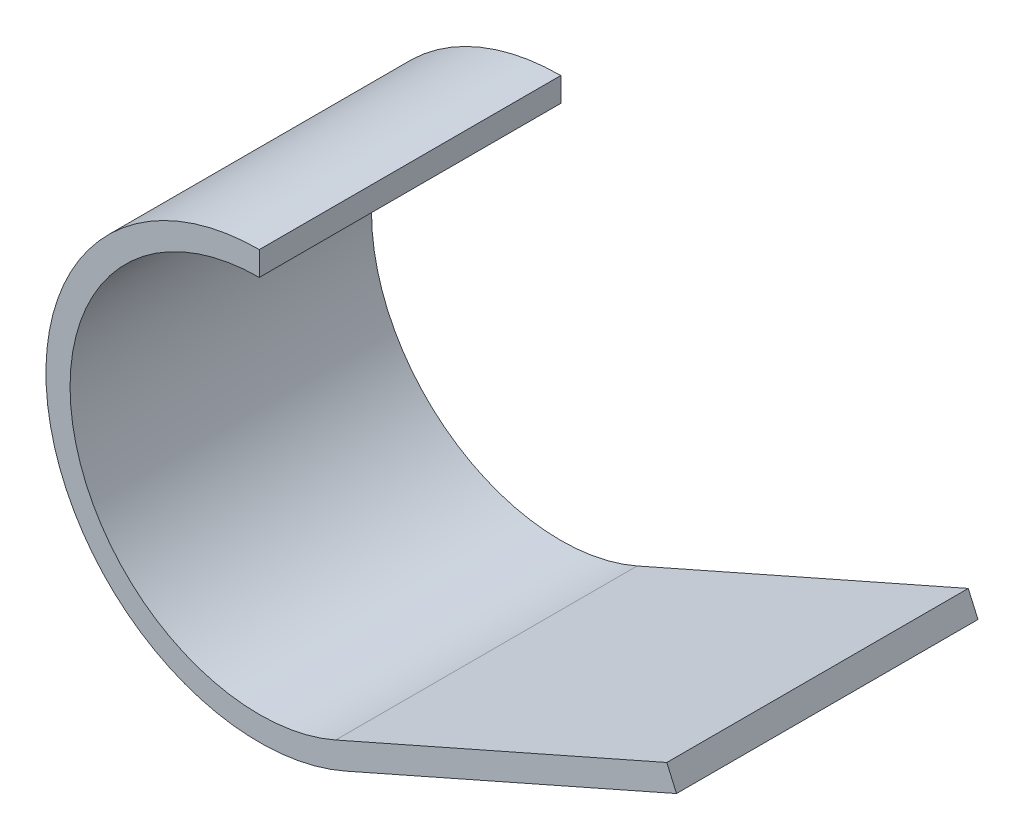
ISO-10303-21;
HEADER;
FILE_DESCRIPTION(('STEP AP214'),'2;1');
FILE_NAME('part.step','',(''),(''),'','','');
FILE_SCHEMA(('AUTOMOTIVE_DESIGN { 1 0 10303 214 1 1 1 1 }'));
ENDSEC;
DATA;
#1=APPLICATION_CONTEXT('core data for automotive mechanical design processes');
#2=APPLICATION_PROTOCOL_DEFINITION('international standard','automotive_design',2000,#1);
#3=PRODUCT_CONTEXT('',#1,'mechanical');
#4=PRODUCT('Part','Part','',(#3));
#5=PRODUCT_RELATED_PRODUCT_CATEGORY('part','',(#4));
#6=PRODUCT_DEFINITION_FORMATION('','',#4);
#7=PRODUCT_DEFINITION_CONTEXT('part definition',#1,'design');
#8=PRODUCT_DEFINITION('design','',#6,#7);
#9=PRODUCT_DEFINITION_SHAPE('','',#8);
#10=(LENGTH_UNIT() NAMED_UNIT(*) SI_UNIT(.MILLI.,.METRE.));
#11=(NAMED_UNIT(*) PLANE_ANGLE_UNIT() SI_UNIT($,.RADIAN.));
#12=(NAMED_UNIT(*) SI_UNIT($,.STERADIAN.) SOLID_ANGLE_UNIT());
#13=UNCERTAINTY_MEASURE_WITH_UNIT(LENGTH_MEASURE(1.E-05),#10,'distance_accuracy_value','');
#14=(GEOMETRIC_REPRESENTATION_CONTEXT(3) GLOBAL_UNCERTAINTY_ASSIGNED_CONTEXT((#13)) GLOBAL_UNIT_ASSIGNED_CONTEXT((#10,
#11,#12)) REPRESENTATION_CONTEXT('',''));
#15=CARTESIAN_POINT('',(0.,0.,0.));
#16=DIRECTION('',(0.,0.,1.));
#17=DIRECTION('',(1.,0.,0.));
#18=AXIS2_PLACEMENT_3D('',#15,#16,#17);
#19=CARTESIAN_POINT('',(25.5491782018338,-4.07503341783489,25.));
#20=DIRECTION('',(-0.403684262707082,0.914898363777441,0.));
#21=DIRECTION('',(-0.914898363777441,-0.403684262707082,0.));
#22=AXIS2_PLACEMENT_3D('',#19,#20,#21);
#23=PLANE('',#22);
#24=DIRECTION('',(0.914898363777441,0.403684262707082,0.));
#25=VECTOR('',#24,1.);
#26=CARTESIAN_POINT('',(25.5491782018338,-4.07503341783489,0.));
#27=LINE('',#26,#25);
#28=CARTESIAN_POINT('',(-1.90451938224641,-16.1885381595579,0.));
#29=VERTEX_POINT('',#28);
#30=CARTESIAN_POINT('',(25.5491782018338,-4.07503341783489,0.));
#31=VERTEX_POINT('',#30);
#32=EDGE_CURVE('E114',#29,#31,#27,.T.);
#33=ORIENTED_EDGE('',*,*,#32,.T.);
#34=DIRECTION('',(0.,0.,-1.));
#35=VECTOR('',#34,1.);
#36=CARTESIAN_POINT('',(25.5491782018338,-4.07503341783489,25.));
#37=LINE('',#36,#35);
#38=CARTESIAN_POINT('',(25.5491782018338,-4.07503341783489,25.));
#39=VERTEX_POINT('',#38);
#40=EDGE_CURVE('E11',#39,#31,#37,.T.);
#41=ORIENTED_EDGE('',*,*,#40,.F.);
#42=DIRECTION('',(0.914898363777441,0.403684262707082,0.));
#43=VECTOR('',#42,1.);
#44=CARTESIAN_POINT('',(25.5491782018338,-4.07503341783489,25.));
#45=LINE('',#44,#43);
#46=CARTESIAN_POINT('',(-1.90451938224641,-16.1885381595579,25.));
#47=VERTEX_POINT('',#46);
#48=EDGE_CURVE('E79',#47,#39,#45,.T.);
#49=ORIENTED_EDGE('',*,*,#48,.F.);
#50=DIRECTION('',(0.,0.,-1.));
#51=VECTOR('',#50,1.);
#52=CARTESIAN_POINT('',(-1.90451938224641,-16.1885381595579,25.));
#53=LINE('',#52,#51);
#54=EDGE_CURVE('E110',#47,#29,#53,.T.);
#55=ORIENTED_EDGE('',*,*,#54,.T.);
#56=EDGE_LOOP('',(#33,#41,#49,#55));
#57=FACE_BOUND('',#56,.T.);
#58=ADVANCED_FACE('F33',(#57),#23,.F.);
#59=CARTESIAN_POINT('',(24.7418096764197,-2.24523669028001,25.));
#60=DIRECTION('',(0.914898363777442,0.403684262707082,0.));
#61=DIRECTION('',(-0.403684262707082,0.914898363777442,0.));
#62=AXIS2_PLACEMENT_3D('',#59,#60,#61);
#63=PLANE('',#62);
#64=DIRECTION('',(0.403684262707082,-0.914898363777442,0.));
#65=VECTOR('',#64,1.);
#66=CARTESIAN_POINT('',(24.7418096764197,-2.24523669028001,0.));
#67=LINE('',#66,#65);
#68=CARTESIAN_POINT('',(24.7418096764197,-2.24523669028001,0.));
#69=VERTEX_POINT('',#68);
#70=EDGE_CURVE('E117',#69,#31,#67,.T.);
#71=ORIENTED_EDGE('',*,*,#70,.F.);
#72=DIRECTION('',(0.,0.,-1.));
#73=VECTOR('',#72,1.);
#74=CARTESIAN_POINT('',(24.7418096764197,-2.24523669028001,25.));
#75=LINE('',#74,#73);
#76=CARTESIAN_POINT('',(24.7418096764197,-2.24523669028001,25.));
#77=VERTEX_POINT('',#76);
#78=EDGE_CURVE('E41',#77,#69,#75,.T.);
#79=ORIENTED_EDGE('',*,*,#78,.F.);
#80=DIRECTION('',(0.403684262707082,-0.914898363777442,0.));
#81=VECTOR('',#80,1.);
#82=CARTESIAN_POINT('',(24.7418096764197,-2.24523669028001,25.));
#83=LINE('',#82,#81);
#84=EDGE_CURVE('E203',#77,#39,#83,.T.);
#85=ORIENTED_EDGE('',*,*,#84,.T.);
#86=ORIENTED_EDGE('',*,*,#40,.T.);
#87=EDGE_LOOP('',(#71,#79,#85,#86));
#88=FACE_BOUND('',#87,.T.);
#89=ADVANCED_FACE('F135',(#88),#63,.T.);
#90=CARTESIAN_POINT('',(24.7418096764197,-2.24523669028001,25.));
#91=DIRECTION('',(-0.403684262707082,0.914898363777441,0.));
#92=DIRECTION('',(-0.914898363777441,-0.403684262707082,0.));
#93=AXIS2_PLACEMENT_3D('',#90,#91,#92);
#94=PLANE('',#93);
#95=DIRECTION('',(0.914898363777441,0.403684262707082,0.));
#96=VECTOR('',#95,1.);
#97=CARTESIAN_POINT('',(24.7418096764197,-2.24523669028001,0.));
#98=LINE('',#97,#96);
#99=CARTESIAN_POINT('',(-2.71188790766057,-14.358741432003,0.));
#100=VERTEX_POINT('',#99);
#101=EDGE_CURVE('E120',#100,#69,#98,.T.);
#102=ORIENTED_EDGE('',*,*,#101,.F.);
#103=DIRECTION('',(0.,0.,-1.));
#104=VECTOR('',#103,1.);
#105=CARTESIAN_POINT('',(-2.71188790766057,-14.358741432003,25.));
#106=LINE('',#105,#104);
#107=CARTESIAN_POINT('',(-2.71188790766057,-14.358741432003,25.));
#108=VERTEX_POINT('',#107);
#109=EDGE_CURVE('E100',#108,#100,#106,.T.);
#110=ORIENTED_EDGE('',*,*,#109,.F.);
#111=DIRECTION('',(0.914898363777441,0.403684262707082,0.));
#112=VECTOR('',#111,1.);
#113=CARTESIAN_POINT('',(24.7418096764197,-2.24523669028001,25.));
#114=LINE('',#113,#112);
#115=EDGE_CURVE('E106',#108,#77,#114,.T.);
#116=ORIENTED_EDGE('',*,*,#115,.T.);
#117=ORIENTED_EDGE('',*,*,#78,.T.);
#118=EDGE_LOOP('',(#102,#110,#116,#117));
#119=FACE_BOUND('',#118,.T.);
#120=ADVANCED_FACE('F132',(#119),#94,.T.);
#121=CARTESIAN_POINT('',(-9.04745279428637,0.,25.));
#122=DIRECTION('',(0.,0.,-1.));
#123=DIRECTION('',(-1.,0.,0.));
#124=AXIS2_PLACEMENT_3D('',#121,#122,#123);
#125=CYLINDRICAL_SURFACE('',#124,15.6943568821333);
#126=CARTESIAN_POINT('',(-9.04745279428637,0.,0.));
#127=DIRECTION('',(0.,0.,1.));
#128=DIRECTION('',(1.,0.,0.));
#129=AXIS2_PLACEMENT_3D('',#126,#127,#128);
#130=CIRCLE('',#129,15.6943568821333);
#131=CARTESIAN_POINT('',(-9.04745279428637,15.6943568821333,0.));
#132=VERTEX_POINT('',#131);
#133=EDGE_CURVE('E95',#132,#100,#130,.T.);
#134=ORIENTED_EDGE('',*,*,#133,.F.);
#135=DIRECTION('',(0.,0.,-1.));
#136=VECTOR('',#135,1.);
#137=CARTESIAN_POINT('',(-9.04745279428637,15.6943568821333,25.));
#138=LINE('',#137,#136);
#139=CARTESIAN_POINT('',(-9.04745279428637,15.6943568821333,25.));
#140=VERTEX_POINT('',#139);
#141=EDGE_CURVE('E90',#140,#132,#138,.T.);
#142=ORIENTED_EDGE('',*,*,#141,.F.);
#143=CARTESIAN_POINT('',(-9.04745279428637,0.,25.));
#144=DIRECTION('',(0.,0.,1.));
#145=DIRECTION('',(1.,0.,0.));
#146=AXIS2_PLACEMENT_3D('',#143,#144,#145);
#147=CIRCLE('',#146,15.6943568821333);
#148=EDGE_CURVE('E93',#140,#108,#147,.T.);
#149=ORIENTED_EDGE('',*,*,#148,.T.);
#150=ORIENTED_EDGE('',*,*,#109,.T.);
#151=EDGE_LOOP('',(#134,#142,#149,#150));
#152=FACE_BOUND('',#151,.T.);
#153=ADVANCED_FACE('F92',(#152),#125,.F.);
#154=CARTESIAN_POINT('',(-9.04745279428637,17.6943568821333,25.));
#155=DIRECTION('',(1.,0.,0.));
#156=DIRECTION('',(0.,0.,-1.));
#157=AXIS2_PLACEMENT_3D('',#154,#155,#156);
#158=PLANE('',#157);
#159=DIRECTION('',(0.,-1.,0.));
#160=VECTOR('',#159,1.);
#161=CARTESIAN_POINT('',(-9.04745279428637,17.6943568821333,0.));
#162=LINE('',#161,#160);
#163=CARTESIAN_POINT('',(-9.04745279428637,17.6943568821333,0.));
#164=VERTEX_POINT('',#163);
#165=EDGE_CURVE('E124',#164,#132,#162,.T.);
#166=ORIENTED_EDGE('',*,*,#165,.F.);
#167=DIRECTION('',(0.,0.,-1.));
#168=VECTOR('',#167,1.);
#169=CARTESIAN_POINT('',(-9.04745279428637,17.6943568821333,25.));
#170=LINE('',#169,#168);
#171=CARTESIAN_POINT('',(-9.04745279428637,17.6943568821333,25.));
#172=VERTEX_POINT('',#171);
#173=EDGE_CURVE('E70',#172,#164,#170,.T.);
#174=ORIENTED_EDGE('',*,*,#173,.F.);
#175=DIRECTION('',(0.,-1.,0.));
#176=VECTOR('',#175,1.);
#177=CARTESIAN_POINT('',(-9.04745279428637,17.6943568821333,25.));
#178=LINE('',#177,#176);
#179=EDGE_CURVE('E104',#172,#140,#178,.T.);
#180=ORIENTED_EDGE('',*,*,#179,.T.);
#181=ORIENTED_EDGE('',*,*,#141,.T.);
#182=EDGE_LOOP('',(#166,#174,#180,#181));
#183=FACE_BOUND('',#182,.T.);
#184=ADVANCED_FACE('F108',(#183),#158,.T.);
#185=CARTESIAN_POINT('',(-9.04745279428637,0.,25.));
#186=DIRECTION('',(0.,0.,-1.));
#187=DIRECTION('',(-1.,0.,0.));
#188=AXIS2_PLACEMENT_3D('',#185,#186,#187);
#189=CYLINDRICAL_SURFACE('',#188,17.6943568821333);
#190=CARTESIAN_POINT('',(-9.04745279428637,0.,0.));
#191=DIRECTION('',(0.,0.,1.));
#192=DIRECTION('',(1.,0.,0.));
#193=AXIS2_PLACEMENT_3D('',#190,#191,#192);
#194=CIRCLE('',#193,17.6943568821333);
#195=EDGE_CURVE('E73',#164,#29,#194,.T.);
#196=ORIENTED_EDGE('',*,*,#195,.T.);
#197=ORIENTED_EDGE('',*,*,#54,.F.);
#198=CARTESIAN_POINT('',(-9.04745279428637,0.,25.));
#199=DIRECTION('',(0.,0.,1.));
#200=DIRECTION('',(1.,0.,0.));
#201=AXIS2_PLACEMENT_3D('',#198,#199,#200);
#202=CIRCLE('',#201,17.6943568821333);
#203=EDGE_CURVE('E49',#172,#47,#202,.T.);
#204=ORIENTED_EDGE('',*,*,#203,.F.);
#205=ORIENTED_EDGE('',*,*,#173,.T.);
#206=EDGE_LOOP('',(#196,#197,#204,#205));
#207=FACE_BOUND('',#206,.T.);
#208=ADVANCED_FACE('F140',(#207),#189,.T.);
#209=CARTESIAN_POINT('',(-9.04745279428637,0.,25.));
#210=DIRECTION('',(0.,0.,1.));
#211=DIRECTION('',(1.,0.,0.));
#212=AXIS2_PLACEMENT_3D('',#209,#210,#211);
#213=PLANE('',#212);
#214=ORIENTED_EDGE('',*,*,#48,.T.);
#215=ORIENTED_EDGE('',*,*,#84,.F.);
#216=ORIENTED_EDGE('',*,*,#115,.F.);
#217=ORIENTED_EDGE('',*,*,#148,.F.);
#218=ORIENTED_EDGE('',*,*,#179,.F.);
#219=ORIENTED_EDGE('',*,*,#203,.T.);
#220=EDGE_LOOP('',(#214,#215,#216,#217,#218,#219));
#221=FACE_BOUND('',#220,.T.);
#222=ADVANCED_FACE('F103',(#221),#213,.T.);
#223=CARTESIAN_POINT('',(-9.04745279428637,0.,0.));
#224=DIRECTION('',(0.,0.,1.));
#225=DIRECTION('',(1.,0.,0.));
#226=AXIS2_PLACEMENT_3D('',#223,#224,#225);
#227=PLANE('',#226);
#228=ORIENTED_EDGE('',*,*,#32,.F.);
#229=ORIENTED_EDGE('',*,*,#195,.F.);
#230=ORIENTED_EDGE('',*,*,#165,.T.);
#231=ORIENTED_EDGE('',*,*,#133,.T.);
#232=ORIENTED_EDGE('',*,*,#101,.T.);
#233=ORIENTED_EDGE('',*,*,#70,.T.);
#234=EDGE_LOOP('',(#228,#229,#230,#231,#232,#233));
#235=FACE_BOUND('',#234,.T.);
#236=ADVANCED_FACE('F138',(#235),#227,.F.);
#237=CLOSED_SHELL('',(#58,#89,#120,#153,#184,#208,#222,#236));
#238=MANIFOLD_SOLID_BREP('B2',#237);
#239=ADVANCED_BREP_SHAPE_REPRESENTATION('',(#18,#238),#14);
#240=SHAPE_DEFINITION_REPRESENTATION(#9,#239);
ENDSEC;
END-ISO-10303-21;
